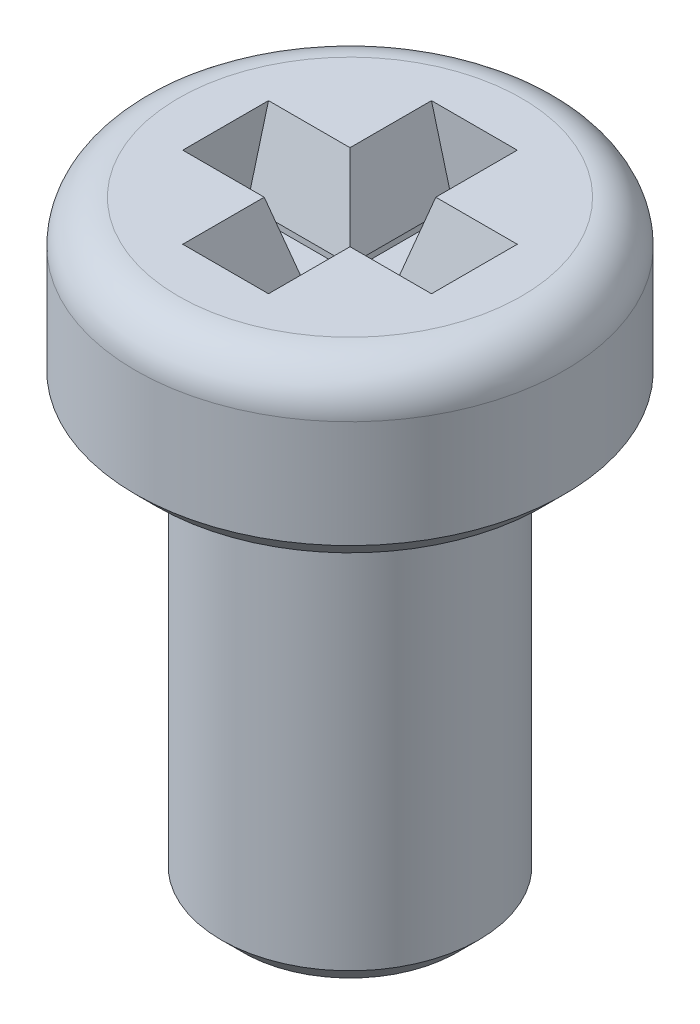
ISO-10303-21;
HEADER;
FILE_DESCRIPTION(('STEP AP214'),'2;1');
FILE_NAME('part.step','',(''),(''),'','','');
FILE_SCHEMA(('AUTOMOTIVE_DESIGN { 1 0 10303 214 1 1 1 1 }'));
ENDSEC;
DATA;
#1=APPLICATION_CONTEXT('core data for automotive mechanical design processes');
#2=APPLICATION_PROTOCOL_DEFINITION('international standard','automotive_design',2000,#1);
#3=PRODUCT_CONTEXT('',#1,'mechanical');
#4=PRODUCT('Part','Part','',(#3));
#5=PRODUCT_RELATED_PRODUCT_CATEGORY('part','',(#4));
#6=PRODUCT_DEFINITION_FORMATION('','',#4);
#7=PRODUCT_DEFINITION_CONTEXT('part definition',#1,'design');
#8=PRODUCT_DEFINITION('design','',#6,#7);
#9=PRODUCT_DEFINITION_SHAPE('','',#8);
#10=(LENGTH_UNIT() NAMED_UNIT(*) SI_UNIT(.MILLI.,.METRE.));
#11=(NAMED_UNIT(*) PLANE_ANGLE_UNIT() SI_UNIT($,.RADIAN.));
#12=(NAMED_UNIT(*) SI_UNIT($,.STERADIAN.) SOLID_ANGLE_UNIT());
#13=UNCERTAINTY_MEASURE_WITH_UNIT(LENGTH_MEASURE(1.E-05),#10,'distance_accuracy_value','');
#14=(GEOMETRIC_REPRESENTATION_CONTEXT(3) GLOBAL_UNCERTAINTY_ASSIGNED_CONTEXT((#13)) GLOBAL_UNIT_ASSIGNED_CONTEXT((#10,
#11,#12)) REPRESENTATION_CONTEXT('',''));
#15=CARTESIAN_POINT('',(0.,0.,0.));
#16=DIRECTION('',(0.,0.,1.));
#17=DIRECTION('',(1.,0.,0.));
#18=AXIS2_PLACEMENT_3D('',#15,#16,#17);
#19=CARTESIAN_POINT('',(0.,2.,0.));
#20=DIRECTION('',(0.,-1.,0.));
#21=DIRECTION('',(0.,0.,-1.));
#22=AXIS2_PLACEMENT_3D('',#19,#20,#21);
#23=CYLINDRICAL_SURFACE('',#22,2.5);
#24=CARTESIAN_POINT('',(0.,1.5,0.));
#25=DIRECTION('',(0.,1.,0.));
#26=DIRECTION('',(0.,0.,1.));
#27=AXIS2_PLACEMENT_3D('',#24,#25,#26);
#28=CIRCLE('',#27,2.5);
#29=CARTESIAN_POINT('',(0.,1.5,2.5));
#30=VERTEX_POINT('',#29);
#31=EDGE_CURVE('E263',#30,#30,#28,.F.);
#32=ORIENTED_EDGE('',*,*,#31,.T.);
#33=EDGE_LOOP('',(#32));
#34=FACE_BOUND('',#33,.T.);
#35=CARTESIAN_POINT('',(0.,0.250000000000001,0.));
#36=DIRECTION('',(0.,1.,0.));
#37=DIRECTION('',(0.,0.,1.));
#38=AXIS2_PLACEMENT_3D('',#35,#36,#37);
#39=CIRCLE('',#38,2.5);
#40=CARTESIAN_POINT('',(0.,0.250000000000001,2.5));
#41=VERTEX_POINT('',#40);
#42=EDGE_CURVE('E254',#41,#41,#39,.T.);
#43=ORIENTED_EDGE('',*,*,#42,.T.);
#44=EDGE_LOOP('',(#43));
#45=FACE_BOUND('',#44,.T.);
#46=ADVANCED_FACE('F32',(#34,#45),#23,.T.);
#47=CARTESIAN_POINT('',(0.,2.,0.));
#48=DIRECTION('',(0.,1.,0.));
#49=DIRECTION('',(0.,0.,1.));
#50=AXIS2_PLACEMENT_3D('',#47,#48,#49);
#51=PLANE('',#50);
#52=DIRECTION('',(1.,0.,0.));
#53=VECTOR('',#52,1.);
#54=CARTESIAN_POINT('',(-0.25,2.,1.45));
#55=LINE('',#54,#53);
#56=CARTESIAN_POINT('',(-0.5,2.,1.45));
#57=VERTEX_POINT('',#56);
#58=CARTESIAN_POINT('',(0.5,2.,1.45));
#59=VERTEX_POINT('',#58);
#60=EDGE_CURVE('E211',#57,#59,#55,.T.);
#61=ORIENTED_EDGE('',*,*,#60,.F.);
#62=DIRECTION('',(0.,0.,-1.));
#63=VECTOR('',#62,1.);
#64=CARTESIAN_POINT('',(-0.5,2.,0.25));
#65=LINE('',#64,#63);
#66=CARTESIAN_POINT('',(-0.5,2.,0.5));
#67=VERTEX_POINT('',#66);
#68=EDGE_CURVE('E287',#57,#67,#65,.T.);
#69=ORIENTED_EDGE('',*,*,#68,.T.);
#70=DIRECTION('',(-1.,0.,0.));
#71=VECTOR('',#70,1.);
#72=CARTESIAN_POINT('',(-1.45,2.,0.5));
#73=LINE('',#72,#71);
#74=CARTESIAN_POINT('',(-1.45,2.,0.5));
#75=VERTEX_POINT('',#74);
#76=EDGE_CURVE('E284',#67,#75,#73,.T.);
#77=ORIENTED_EDGE('',*,*,#76,.T.);
#78=DIRECTION('',(0.,0.,1.));
#79=VECTOR('',#78,1.);
#80=CARTESIAN_POINT('',(-1.45,2.,0.25));
#81=LINE('',#80,#79);
#82=CARTESIAN_POINT('',(-1.45,2.,-0.5));
#83=VERTEX_POINT('',#82);
#84=EDGE_CURVE('E209',#83,#75,#81,.T.);
#85=ORIENTED_EDGE('',*,*,#84,.F.);
#86=DIRECTION('',(1.,0.,0.));
#87=VECTOR('',#86,1.);
#88=CARTESIAN_POINT('',(-0.25,2.,-0.5));
#89=LINE('',#88,#87);
#90=CARTESIAN_POINT('',(-0.5,2.,-0.5));
#91=VERTEX_POINT('',#90);
#92=EDGE_CURVE('E272',#83,#91,#89,.T.);
#93=ORIENTED_EDGE('',*,*,#92,.T.);
#94=DIRECTION('',(0.,0.,-1.));
#95=VECTOR('',#94,1.);
#96=CARTESIAN_POINT('',(-0.5,2.,-1.45));
#97=LINE('',#96,#95);
#98=CARTESIAN_POINT('',(-0.5,2.,-1.45));
#99=VERTEX_POINT('',#98);
#100=EDGE_CURVE('E269',#91,#99,#97,.T.);
#101=ORIENTED_EDGE('',*,*,#100,.T.);
#102=DIRECTION('',(-1.,0.,0.));
#103=VECTOR('',#102,1.);
#104=CARTESIAN_POINT('',(-0.25,2.,-1.45));
#105=LINE('',#104,#103);
#106=CARTESIAN_POINT('',(0.5,2.,-1.45));
#107=VERTEX_POINT('',#106);
#108=EDGE_CURVE('E179',#107,#99,#105,.T.);
#109=ORIENTED_EDGE('',*,*,#108,.F.);
#110=DIRECTION('',(0.,0.,1.));
#111=VECTOR('',#110,1.);
#112=CARTESIAN_POINT('',(0.500000000000001,2.,-0.25));
#113=LINE('',#112,#111);
#114=CARTESIAN_POINT('',(0.500000000000001,2.,-0.500000000000001));
#115=VERTEX_POINT('',#114);
#116=EDGE_CURVE('E274',#107,#115,#113,.T.);
#117=ORIENTED_EDGE('',*,*,#116,.T.);
#118=DIRECTION('',(1.,0.,0.));
#119=VECTOR('',#118,1.);
#120=CARTESIAN_POINT('',(1.45,2.,-0.500000000000001));
#121=LINE('',#120,#119);
#122=CARTESIAN_POINT('',(1.45,2.,-0.500000000000001));
#123=VERTEX_POINT('',#122);
#124=EDGE_CURVE('E276',#115,#123,#121,.T.);
#125=ORIENTED_EDGE('',*,*,#124,.T.);
#126=DIRECTION('',(0.,0.,-1.));
#127=VECTOR('',#126,1.);
#128=CARTESIAN_POINT('',(1.45,2.,0.25));
#129=LINE('',#128,#127);
#130=CARTESIAN_POINT('',(1.45,2.,0.5));
#131=VERTEX_POINT('',#130);
#132=EDGE_CURVE('E181',#131,#123,#129,.T.);
#133=ORIENTED_EDGE('',*,*,#132,.F.);
#134=DIRECTION('',(-1.,0.,0.));
#135=VECTOR('',#134,1.);
#136=CARTESIAN_POINT('',(0.25,2.,0.5));
#137=LINE('',#136,#135);
#138=CARTESIAN_POINT('',(0.5,2.,0.5));
#139=VERTEX_POINT('',#138);
#140=EDGE_CURVE('E279',#131,#139,#137,.T.);
#141=ORIENTED_EDGE('',*,*,#140,.T.);
#142=DIRECTION('',(0.,0.,1.));
#143=VECTOR('',#142,1.);
#144=CARTESIAN_POINT('',(0.5,2.,1.45));
#145=LINE('',#144,#143);
#146=EDGE_CURVE('E281',#139,#59,#145,.T.);
#147=ORIENTED_EDGE('',*,*,#146,.T.);
#148=EDGE_LOOP('',(#61,#69,#77,#85,#93,#101,#109,#117,#125,#133,#141,#147));
#149=FACE_BOUND('',#148,.T.);
#150=CARTESIAN_POINT('',(0.,2.,0.));
#151=DIRECTION('',(0.,1.,0.));
#152=DIRECTION('',(0.,0.,1.));
#153=AXIS2_PLACEMENT_3D('',#150,#151,#152);
#154=CIRCLE('',#153,2.);
#155=CARTESIAN_POINT('',(0.,2.,2.));
#156=VERTEX_POINT('',#155);
#157=EDGE_CURVE('E260',#156,#156,#154,.T.);
#158=ORIENTED_EDGE('',*,*,#157,.T.);
#159=EDGE_LOOP('',(#158));
#160=FACE_BOUND('',#159,.T.);
#161=ADVANCED_FACE('F338',(#149,#160),#51,.T.);
#162=CARTESIAN_POINT('',(0.,0.,0.));
#163=DIRECTION('',(0.,1.,0.));
#164=DIRECTION('',(0.,0.,1.));
#165=AXIS2_PLACEMENT_3D('',#162,#163,#164);
#166=PLANE('',#165);
#167=CARTESIAN_POINT('',(0.,0.,0.));
#168=DIRECTION('',(0.,1.,0.));
#169=DIRECTION('',(0.,0.,1.));
#170=AXIS2_PLACEMENT_3D('',#167,#168,#169);
#171=CIRCLE('',#170,2.25);
#172=CARTESIAN_POINT('',(0.,0.,2.25));
#173=VERTEX_POINT('',#172);
#174=EDGE_CURVE('E257',#173,#173,#171,.F.);
#175=ORIENTED_EDGE('',*,*,#174,.T.);
#176=EDGE_LOOP('',(#175));
#177=FACE_BOUND('',#176,.T.);
#178=CARTESIAN_POINT('',(0.,0.,0.));
#179=DIRECTION('',(0.,1.,0.));
#180=DIRECTION('',(0.,0.,1.));
#181=AXIS2_PLACEMENT_3D('',#178,#179,#180);
#182=CIRCLE('',#181,1.5);
#183=CARTESIAN_POINT('',(0.,0.,1.5));
#184=VERTEX_POINT('',#183);
#185=EDGE_CURVE('E217',#184,#184,#182,.F.);
#186=ORIENTED_EDGE('',*,*,#185,.F.);
#187=EDGE_LOOP('',(#186));
#188=FACE_BOUND('',#187,.T.);
#189=ADVANCED_FACE('F407',(#177,#188),#166,.F.);
#190=CARTESIAN_POINT('',(0.,-5.,0.));
#191=DIRECTION('',(0.,1.,0.));
#192=DIRECTION('',(0.,0.,1.));
#193=AXIS2_PLACEMENT_3D('',#190,#191,#192);
#194=CYLINDRICAL_SURFACE('',#193,1.5);
#195=CARTESIAN_POINT('',(0.,-4.75,0.));
#196=DIRECTION('',(0.,-1.,0.));
#197=DIRECTION('',(0.,0.,-1.));
#198=AXIS2_PLACEMENT_3D('',#195,#196,#197);
#199=CIRCLE('',#198,1.5);
#200=CARTESIAN_POINT('',(0.,-4.75,-1.5));
#201=VERTEX_POINT('',#200);
#202=EDGE_CURVE('E251',#201,#201,#199,.F.);
#203=ORIENTED_EDGE('',*,*,#202,.T.);
#204=EDGE_LOOP('',(#203));
#205=FACE_BOUND('',#204,.T.);
#206=ORIENTED_EDGE('',*,*,#185,.T.);
#207=EDGE_LOOP('',(#206));
#208=FACE_BOUND('',#207,.T.);
#209=ADVANCED_FACE('F461',(#205,#208),#194,.T.);
#210=CARTESIAN_POINT('',(0.,-5.,0.));
#211=DIRECTION('',(0.,-1.,0.));
#212=DIRECTION('',(0.,0.,-1.));
#213=AXIS2_PLACEMENT_3D('',#210,#211,#212);
#214=PLANE('',#213);
#215=CARTESIAN_POINT('',(0.,-5.,0.));
#216=DIRECTION('',(0.,-1.,0.));
#217=DIRECTION('',(0.,0.,-1.));
#218=AXIS2_PLACEMENT_3D('',#215,#216,#217);
#219=CIRCLE('',#218,1.25);
#220=CARTESIAN_POINT('',(0.,-5.,-1.25));
#221=VERTEX_POINT('',#220);
#222=EDGE_CURVE('E248',#221,#221,#219,.T.);
#223=ORIENTED_EDGE('',*,*,#222,.T.);
#224=EDGE_LOOP('',(#223));
#225=FACE_BOUND('',#224,.T.);
#226=ADVANCED_FACE('F416',(#225),#214,.T.);
#227=CARTESIAN_POINT('',(0.,-5.,0.));
#228=DIRECTION('',(0.,1.,0.));
#229=DIRECTION('',(0.,0.,1.));
#230=AXIS2_PLACEMENT_3D('',#227,#228,#229);
#231=CONICAL_SURFACE('',#230,1.25,0.785398163397444);
#232=ORIENTED_EDGE('',*,*,#202,.F.);
#233=EDGE_LOOP('',(#232));
#234=FACE_BOUND('',#233,.T.);
#235=ORIENTED_EDGE('',*,*,#222,.F.);
#236=EDGE_LOOP('',(#235));
#237=FACE_BOUND('',#236,.T.);
#238=ADVANCED_FACE('F412',(#234,#237),#231,.T.);
#239=CARTESIAN_POINT('',(0.,0.250000000000001,0.));
#240=DIRECTION('',(0.,1.,0.));
#241=DIRECTION('',(0.,0.,1.));
#242=AXIS2_PLACEMENT_3D('',#239,#240,#241);
#243=CONICAL_SURFACE('',#242,2.5,0.78539816339745);
#244=ORIENTED_EDGE('',*,*,#174,.F.);
#245=EDGE_LOOP('',(#244));
#246=FACE_BOUND('',#245,.T.);
#247=ORIENTED_EDGE('',*,*,#42,.F.);
#248=EDGE_LOOP('',(#247));
#249=FACE_BOUND('',#248,.T.);
#250=ADVANCED_FACE('F415',(#246,#249),#243,.T.);
#251=CARTESIAN_POINT('',(0.,1.5,0.));
#252=DIRECTION('',(0.,1.,0.));
#253=DIRECTION('',(0.,0.,1.));
#254=AXIS2_PLACEMENT_3D('',#251,#252,#253);
#255=TOROIDAL_SURFACE('',#254,2.,0.5);
#256=ORIENTED_EDGE('',*,*,#31,.F.);
#257=EDGE_LOOP('',(#256));
#258=FACE_BOUND('',#257,.T.);
#259=ORIENTED_EDGE('',*,*,#157,.F.);
#260=EDGE_LOOP('',(#259));
#261=FACE_BOUND('',#260,.T.);
#262=ADVANCED_FACE('F420',(#258,#261),#255,.T.);
#263=CARTESIAN_POINT('',(-0.25,1.,-1.45));
#264=DIRECTION('',(-1.,0.,0.));
#265=DIRECTION('',(0.,0.,1.));
#266=AXIS2_PLACEMENT_3D('',#263,#264,#265);
#267=PLANE('',#266);
#268=DIRECTION('',(0.,1.,0.));
#269=VECTOR('',#268,1.);
#270=CARTESIAN_POINT('',(-0.25,1.,-1.45));
#271=LINE('',#270,#269);
#272=CARTESIAN_POINT('',(-0.25,1.,-1.45));
#273=VERTEX_POINT('',#272);
#274=CARTESIAN_POINT('',(-0.25,1.06698729810778,-1.45));
#275=VERTEX_POINT('',#274);
#276=EDGE_CURVE('E215',#273,#275,#271,.T.);
#277=ORIENTED_EDGE('',*,*,#276,.T.);
#278=DIRECTION('',(0.,0.,1.));
#279=VECTOR('',#278,1.);
#280=CARTESIAN_POINT('',(-0.25,1.06698729810778,-0.25));
#281=LINE('',#280,#279);
#282=CARTESIAN_POINT('',(-0.25,1.06698729810778,-0.25));
#283=VERTEX_POINT('',#282);
#284=EDGE_CURVE('E54',#275,#283,#281,.T.);
#285=ORIENTED_EDGE('',*,*,#284,.T.);
#286=DIRECTION('',(0.,1.,0.));
#287=VECTOR('',#286,1.);
#288=CARTESIAN_POINT('',(-0.25,1.,-0.25));
#289=LINE('',#288,#287);
#290=CARTESIAN_POINT('',(-0.25,1.,-0.25));
#291=VERTEX_POINT('',#290);
#292=EDGE_CURVE('E155',#291,#283,#289,.T.);
#293=ORIENTED_EDGE('',*,*,#292,.F.);
#294=DIRECTION('',(0.,0.,1.));
#295=VECTOR('',#294,1.);
#296=CARTESIAN_POINT('',(-0.25,1.,-1.45));
#297=LINE('',#296,#295);
#298=EDGE_CURVE('E159',#273,#291,#297,.T.);
#299=ORIENTED_EDGE('',*,*,#298,.F.);
#300=EDGE_LOOP('',(#277,#285,#293,#299));
#301=FACE_BOUND('',#300,.T.);
#302=ADVANCED_FACE('F157',(#301),#267,.F.);
#303=CARTESIAN_POINT('',(-0.25,1.,-1.45));
#304=DIRECTION('',(0.,0.,-1.));
#305=DIRECTION('',(-1.,0.,0.));
#306=AXIS2_PLACEMENT_3D('',#303,#304,#305);
#307=PLANE('',#306);
#308=ORIENTED_EDGE('',*,*,#108,.T.);
#309=DIRECTION('',(0.258819045102521,-0.965925826289068,0.));
#310=VECTOR('',#309,1.);
#311=CARTESIAN_POINT('',(-0.233253175473055,1.00448729810778,-1.45));
#312=LINE('',#311,#310);
#313=EDGE_CURVE('E11',#99,#275,#312,.T.);
#314=ORIENTED_EDGE('',*,*,#313,.T.);
#315=ORIENTED_EDGE('',*,*,#276,.F.);
#316=DIRECTION('',(-1.,0.,0.));
#317=VECTOR('',#316,1.);
#318=CARTESIAN_POINT('',(-0.25,1.,-1.45));
#319=LINE('',#318,#317);
#320=CARTESIAN_POINT('',(0.25,1.,-1.45));
#321=VERTEX_POINT('',#320);
#322=EDGE_CURVE('E165',#321,#273,#319,.T.);
#323=ORIENTED_EDGE('',*,*,#322,.F.);
#324=DIRECTION('',(0.,1.,0.));
#325=VECTOR('',#324,1.);
#326=CARTESIAN_POINT('',(0.25,1.,-1.45));
#327=LINE('',#326,#325);
#328=CARTESIAN_POINT('',(0.25,1.06698729810778,-1.45));
#329=VERTEX_POINT('',#328);
#330=EDGE_CURVE('E218',#321,#329,#327,.T.);
#331=ORIENTED_EDGE('',*,*,#330,.T.);
#332=DIRECTION('',(0.258819045102521,0.965925826289068,0.));
#333=VECTOR('',#332,1.);
#334=CARTESIAN_POINT('',(0.199759526419164,0.87948729810778,-1.45));
#335=LINE('',#334,#333);
#336=EDGE_CURVE('E316',#329,#107,#335,.T.);
#337=ORIENTED_EDGE('',*,*,#336,.T.);
#338=EDGE_LOOP('',(#308,#314,#315,#323,#331,#337));
#339=FACE_BOUND('',#338,.T.);
#340=ADVANCED_FACE('F375',(#339),#307,.F.);
#341=CARTESIAN_POINT('',(0.25,1.,-1.45));
#342=DIRECTION('',(1.,0.,0.));
#343=DIRECTION('',(0.,0.,-1.));
#344=AXIS2_PLACEMENT_3D('',#341,#342,#343);
#345=PLANE('',#344);
#346=DIRECTION('',(0.,1.,0.));
#347=VECTOR('',#346,1.);
#348=CARTESIAN_POINT('',(0.25,1.,-0.25));
#349=LINE('',#348,#347);
#350=CARTESIAN_POINT('',(0.25,1.,-0.25));
#351=VERTEX_POINT('',#350);
#352=CARTESIAN_POINT('',(0.25,1.06698729810778,-0.25));
#353=VERTEX_POINT('',#352);
#354=EDGE_CURVE('E221',#351,#353,#349,.T.);
#355=ORIENTED_EDGE('',*,*,#354,.T.);
#356=DIRECTION('',(0.,0.,-1.));
#357=VECTOR('',#356,1.);
#358=CARTESIAN_POINT('',(0.25,1.06698729810778,-1.45));
#359=LINE('',#358,#357);
#360=EDGE_CURVE('E299',#353,#329,#359,.T.);
#361=ORIENTED_EDGE('',*,*,#360,.T.);
#362=ORIENTED_EDGE('',*,*,#330,.F.);
#363=DIRECTION('',(0.,0.,-1.));
#364=VECTOR('',#363,1.);
#365=CARTESIAN_POINT('',(0.25,1.,-1.45));
#366=LINE('',#365,#364);
#367=EDGE_CURVE('E206',#351,#321,#366,.T.);
#368=ORIENTED_EDGE('',*,*,#367,.F.);
#369=EDGE_LOOP('',(#355,#361,#362,#368));
#370=FACE_BOUND('',#369,.T.);
#371=ADVANCED_FACE('F373',(#370),#345,.F.);
#372=CARTESIAN_POINT('',(0.25,1.,-0.25));
#373=DIRECTION('',(0.,0.,-1.));
#374=DIRECTION('',(-1.,0.,0.));
#375=AXIS2_PLACEMENT_3D('',#372,#373,#374);
#376=PLANE('',#375);
#377=DIRECTION('',(0.,1.,0.));
#378=VECTOR('',#377,1.);
#379=CARTESIAN_POINT('',(1.45,1.,-0.25));
#380=LINE('',#379,#378);
#381=CARTESIAN_POINT('',(1.45,1.,-0.25));
#382=VERTEX_POINT('',#381);
#383=CARTESIAN_POINT('',(1.45,1.06698729810778,-0.25));
#384=VERTEX_POINT('',#383);
#385=EDGE_CURVE('E224',#382,#384,#380,.T.);
#386=ORIENTED_EDGE('',*,*,#385,.T.);
#387=DIRECTION('',(-1.,0.,0.));
#388=VECTOR('',#387,1.);
#389=CARTESIAN_POINT('',(0.25,1.06698729810778,-0.25));
#390=LINE('',#389,#388);
#391=EDGE_CURVE('E296',#384,#353,#390,.T.);
#392=ORIENTED_EDGE('',*,*,#391,.T.);
#393=ORIENTED_EDGE('',*,*,#354,.F.);
#394=DIRECTION('',(-1.,0.,0.));
#395=VECTOR('',#394,1.);
#396=CARTESIAN_POINT('',(0.25,1.,-0.25));
#397=LINE('',#396,#395);
#398=EDGE_CURVE('E203',#382,#351,#397,.T.);
#399=ORIENTED_EDGE('',*,*,#398,.F.);
#400=EDGE_LOOP('',(#386,#392,#393,#399));
#401=FACE_BOUND('',#400,.T.);
#402=ADVANCED_FACE('F371',(#401),#376,.F.);
#403=CARTESIAN_POINT('',(1.45,1.,0.25));
#404=DIRECTION('',(1.,0.,0.));
#405=DIRECTION('',(0.,0.,-1.));
#406=AXIS2_PLACEMENT_3D('',#403,#404,#405);
#407=PLANE('',#406);
#408=ORIENTED_EDGE('',*,*,#132,.T.);
#409=DIRECTION('',(0.,-0.965925826289068,0.258819045102521));
#410=VECTOR('',#409,1.);
#411=CARTESIAN_POINT('',(1.45,0.87948729810778,-0.199759526419165));
#412=LINE('',#411,#410);
#413=EDGE_CURVE('E314',#123,#384,#412,.T.);
#414=ORIENTED_EDGE('',*,*,#413,.T.);
#415=ORIENTED_EDGE('',*,*,#385,.F.);
#416=DIRECTION('',(0.,0.,-1.));
#417=VECTOR('',#416,1.);
#418=CARTESIAN_POINT('',(1.45,1.,0.25));
#419=LINE('',#418,#417);
#420=CARTESIAN_POINT('',(1.45,1.,0.25));
#421=VERTEX_POINT('',#420);
#422=EDGE_CURVE('E200',#421,#382,#419,.T.);
#423=ORIENTED_EDGE('',*,*,#422,.F.);
#424=DIRECTION('',(0.,1.,0.));
#425=VECTOR('',#424,1.);
#426=CARTESIAN_POINT('',(1.45,1.,0.25));
#427=LINE('',#426,#425);
#428=CARTESIAN_POINT('',(1.45,1.06698729810778,0.25));
#429=VERTEX_POINT('',#428);
#430=EDGE_CURVE('E227',#421,#429,#427,.T.);
#431=ORIENTED_EDGE('',*,*,#430,.T.);
#432=DIRECTION('',(0.,0.965925826289068,0.258819045102521));
#433=VECTOR('',#432,1.);
#434=CARTESIAN_POINT('',(1.45,1.00448729810778,0.233253175473055));
#435=LINE('',#434,#433);
#436=EDGE_CURVE('E311',#429,#131,#435,.T.);
#437=ORIENTED_EDGE('',*,*,#436,.T.);
#438=EDGE_LOOP('',(#408,#414,#415,#423,#431,#437));
#439=FACE_BOUND('',#438,.T.);
#440=ADVANCED_FACE('F367',(#439),#407,.F.);
#441=CARTESIAN_POINT('',(0.25,1.,0.25));
#442=DIRECTION('',(0.,0.,1.));
#443=DIRECTION('',(1.,0.,0.));
#444=AXIS2_PLACEMENT_3D('',#441,#442,#443);
#445=PLANE('',#444);
#446=DIRECTION('',(0.,1.,0.));
#447=VECTOR('',#446,1.);
#448=CARTESIAN_POINT('',(0.25,1.,0.25));
#449=LINE('',#448,#447);
#450=CARTESIAN_POINT('',(0.25,1.,0.25));
#451=VERTEX_POINT('',#450);
#452=CARTESIAN_POINT('',(0.25,1.06698729810778,0.25));
#453=VERTEX_POINT('',#452);
#454=EDGE_CURVE('E230',#451,#453,#449,.T.);
#455=ORIENTED_EDGE('',*,*,#454,.T.);
#456=DIRECTION('',(1.,0.,0.));
#457=VECTOR('',#456,1.);
#458=CARTESIAN_POINT('',(1.45,1.06698729810778,0.25));
#459=LINE('',#458,#457);
#460=EDGE_CURVE('E294',#453,#429,#459,.T.);
#461=ORIENTED_EDGE('',*,*,#460,.T.);
#462=ORIENTED_EDGE('',*,*,#430,.F.);
#463=DIRECTION('',(1.,0.,0.));
#464=VECTOR('',#463,1.);
#465=CARTESIAN_POINT('',(0.25,1.,0.25));
#466=LINE('',#465,#464);
#467=EDGE_CURVE('E197',#451,#421,#466,.T.);
#468=ORIENTED_EDGE('',*,*,#467,.F.);
#469=EDGE_LOOP('',(#455,#461,#462,#468));
#470=FACE_BOUND('',#469,.T.);
#471=ADVANCED_FACE('F362',(#470),#445,.F.);
#472=CARTESIAN_POINT('',(0.25,1.,0.25));
#473=DIRECTION('',(1.,0.,0.));
#474=DIRECTION('',(0.,0.,-1.));
#475=AXIS2_PLACEMENT_3D('',#472,#473,#474);
#476=PLANE('',#475);
#477=DIRECTION('',(0.,1.,0.));
#478=VECTOR('',#477,1.);
#479=CARTESIAN_POINT('',(0.25,1.,1.45));
#480=LINE('',#479,#478);
#481=CARTESIAN_POINT('',(0.25,1.,1.45));
#482=VERTEX_POINT('',#481);
#483=CARTESIAN_POINT('',(0.25,1.06698729810778,1.45));
#484=VERTEX_POINT('',#483);
#485=EDGE_CURVE('E233',#482,#484,#480,.T.);
#486=ORIENTED_EDGE('',*,*,#485,.T.);
#487=DIRECTION('',(0.,0.,-1.));
#488=VECTOR('',#487,1.);
#489=CARTESIAN_POINT('',(0.25,1.06698729810778,0.25));
#490=LINE('',#489,#488);
#491=EDGE_CURVE('E291',#484,#453,#490,.T.);
#492=ORIENTED_EDGE('',*,*,#491,.T.);
#493=ORIENTED_EDGE('',*,*,#454,.F.);
#494=DIRECTION('',(0.,0.,-1.));
#495=VECTOR('',#494,1.);
#496=CARTESIAN_POINT('',(0.25,1.,0.25));
#497=LINE('',#496,#495);
#498=EDGE_CURVE('E194',#482,#451,#497,.T.);
#499=ORIENTED_EDGE('',*,*,#498,.F.);
#500=EDGE_LOOP('',(#486,#492,#493,#499));
#501=FACE_BOUND('',#500,.T.);
#502=ADVANCED_FACE('F359',(#501),#476,.F.);
#503=CARTESIAN_POINT('',(-0.25,1.,1.45));
#504=DIRECTION('',(0.,0.,1.));
#505=DIRECTION('',(1.,0.,0.));
#506=AXIS2_PLACEMENT_3D('',#503,#504,#505);
#507=PLANE('',#506);
#508=ORIENTED_EDGE('',*,*,#60,.T.);
#509=DIRECTION('',(-0.258819045102521,-0.965925826289068,0.));
#510=VECTOR('',#509,1.);
#511=CARTESIAN_POINT('',(0.199759526419164,0.879487298107781,1.45));
#512=LINE('',#511,#510);
#513=EDGE_CURVE('E309',#59,#484,#512,.T.);
#514=ORIENTED_EDGE('',*,*,#513,.T.);
#515=ORIENTED_EDGE('',*,*,#485,.F.);
#516=DIRECTION('',(1.,0.,0.));
#517=VECTOR('',#516,1.);
#518=CARTESIAN_POINT('',(-0.25,1.,1.45));
#519=LINE('',#518,#517);
#520=CARTESIAN_POINT('',(-0.25,1.,1.45));
#521=VERTEX_POINT('',#520);
#522=EDGE_CURVE('E191',#521,#482,#519,.T.);
#523=ORIENTED_EDGE('',*,*,#522,.F.);
#524=DIRECTION('',(0.,1.,0.));
#525=VECTOR('',#524,1.);
#526=CARTESIAN_POINT('',(-0.25,1.,1.45));
#527=LINE('',#526,#525);
#528=CARTESIAN_POINT('',(-0.25,1.06698729810778,1.45));
#529=VERTEX_POINT('',#528);
#530=EDGE_CURVE('E236',#521,#529,#527,.T.);
#531=ORIENTED_EDGE('',*,*,#530,.T.);
#532=DIRECTION('',(-0.258819045102521,0.965925826289068,0.));
#533=VECTOR('',#532,1.);
#534=CARTESIAN_POINT('',(-0.233253175473054,1.00448729810778,1.45));
#535=LINE('',#534,#533);
#536=EDGE_CURVE('E304',#529,#57,#535,.T.);
#537=ORIENTED_EDGE('',*,*,#536,.T.);
#538=EDGE_LOOP('',(#508,#514,#515,#523,#531,#537));
#539=FACE_BOUND('',#538,.T.);
#540=ADVANCED_FACE('F355',(#539),#507,.F.);
#541=CARTESIAN_POINT('',(-0.25,1.,0.25));
#542=DIRECTION('',(-1.,0.,0.));
#543=DIRECTION('',(0.,0.,1.));
#544=AXIS2_PLACEMENT_3D('',#541,#542,#543);
#545=PLANE('',#544);
#546=DIRECTION('',(0.,1.,0.));
#547=VECTOR('',#546,1.);
#548=CARTESIAN_POINT('',(-0.25,1.,0.25));
#549=LINE('',#548,#547);
#550=CARTESIAN_POINT('',(-0.25,1.,0.25));
#551=VERTEX_POINT('',#550);
#552=CARTESIAN_POINT('',(-0.25,1.06698729810778,0.25));
#553=VERTEX_POINT('',#552);
#554=EDGE_CURVE('E239',#551,#553,#549,.T.);
#555=ORIENTED_EDGE('',*,*,#554,.T.);
#556=DIRECTION('',(0.,0.,1.));
#557=VECTOR('',#556,1.);
#558=CARTESIAN_POINT('',(-0.25,1.06698729810778,1.45));
#559=LINE('',#558,#557);
#560=EDGE_CURVE('E266',#553,#529,#559,.T.);
#561=ORIENTED_EDGE('',*,*,#560,.T.);
#562=ORIENTED_EDGE('',*,*,#530,.F.);
#563=DIRECTION('',(0.,0.,1.));
#564=VECTOR('',#563,1.);
#565=CARTESIAN_POINT('',(-0.25,1.,0.25));
#566=LINE('',#565,#564);
#567=EDGE_CURVE('E188',#551,#521,#566,.T.);
#568=ORIENTED_EDGE('',*,*,#567,.F.);
#569=EDGE_LOOP('',(#555,#561,#562,#568));
#570=FACE_BOUND('',#569,.T.);
#571=ADVANCED_FACE('F351',(#570),#545,.F.);
#572=CARTESIAN_POINT('',(-1.45,1.,0.25));
#573=DIRECTION('',(0.,0.,1.));
#574=DIRECTION('',(1.,0.,0.));
#575=AXIS2_PLACEMENT_3D('',#572,#573,#574);
#576=PLANE('',#575);
#577=DIRECTION('',(0.,1.,0.));
#578=VECTOR('',#577,1.);
#579=CARTESIAN_POINT('',(-1.45,1.,0.25));
#580=LINE('',#579,#578);
#581=CARTESIAN_POINT('',(-1.45,1.,0.25));
#582=VERTEX_POINT('',#581);
#583=CARTESIAN_POINT('',(-1.45,1.06698729810778,0.25));
#584=VERTEX_POINT('',#583);
#585=EDGE_CURVE('E242',#582,#584,#580,.T.);
#586=ORIENTED_EDGE('',*,*,#585,.T.);
#587=DIRECTION('',(1.,0.,0.));
#588=VECTOR('',#587,1.);
#589=CARTESIAN_POINT('',(-0.25,1.06698729810778,0.25));
#590=LINE('',#589,#588);
#591=EDGE_CURVE('E289',#584,#553,#590,.T.);
#592=ORIENTED_EDGE('',*,*,#591,.T.);
#593=ORIENTED_EDGE('',*,*,#554,.F.);
#594=DIRECTION('',(1.,0.,0.));
#595=VECTOR('',#594,1.);
#596=CARTESIAN_POINT('',(-1.45,1.,0.25));
#597=LINE('',#596,#595);
#598=EDGE_CURVE('E185',#582,#551,#597,.T.);
#599=ORIENTED_EDGE('',*,*,#598,.F.);
#600=EDGE_LOOP('',(#586,#592,#593,#599));
#601=FACE_BOUND('',#600,.T.);
#602=ADVANCED_FACE('F347',(#601),#576,.F.);
#603=CARTESIAN_POINT('',(-1.45,1.,0.25));
#604=DIRECTION('',(-1.,0.,0.));
#605=DIRECTION('',(0.,0.,1.));
#606=AXIS2_PLACEMENT_3D('',#603,#604,#605);
#607=PLANE('',#606);
#608=ORIENTED_EDGE('',*,*,#84,.T.);
#609=DIRECTION('',(0.,-0.965925826289068,-0.258819045102521));
#610=VECTOR('',#609,1.);
#611=CARTESIAN_POINT('',(-1.45,1.00448729810778,0.233253175473055));
#612=LINE('',#611,#610);
#613=EDGE_CURVE('E307',#75,#584,#612,.T.);
#614=ORIENTED_EDGE('',*,*,#613,.T.);
#615=ORIENTED_EDGE('',*,*,#585,.F.);
#616=DIRECTION('',(0.,0.,1.));
#617=VECTOR('',#616,1.);
#618=CARTESIAN_POINT('',(-1.45,1.,0.25));
#619=LINE('',#618,#617);
#620=CARTESIAN_POINT('',(-1.45,1.,-0.25));
#621=VERTEX_POINT('',#620);
#622=EDGE_CURVE('E174',#621,#582,#619,.T.);
#623=ORIENTED_EDGE('',*,*,#622,.F.);
#624=DIRECTION('',(0.,1.,0.));
#625=VECTOR('',#624,1.);
#626=CARTESIAN_POINT('',(-1.45,1.,-0.25));
#627=LINE('',#626,#625);
#628=CARTESIAN_POINT('',(-1.45,1.06698729810778,-0.25));
#629=VERTEX_POINT('',#628);
#630=EDGE_CURVE('E164',#621,#629,#627,.T.);
#631=ORIENTED_EDGE('',*,*,#630,.T.);
#632=DIRECTION('',(0.,0.965925826289068,-0.258819045102521));
#633=VECTOR('',#632,1.);
#634=CARTESIAN_POINT('',(-1.45,0.87948729810778,-0.199759526419164));
#635=LINE('',#634,#633);
#636=EDGE_CURVE('E41',#629,#83,#635,.T.);
#637=ORIENTED_EDGE('',*,*,#636,.T.);
#638=EDGE_LOOP('',(#608,#614,#615,#623,#631,#637));
#639=FACE_BOUND('',#638,.T.);
#640=ADVANCED_FACE('F343',(#639),#607,.F.);
#641=CARTESIAN_POINT('',(-1.45,1.,-0.25));
#642=DIRECTION('',(0.,0.,-1.));
#643=DIRECTION('',(-1.,0.,0.));
#644=AXIS2_PLACEMENT_3D('',#641,#642,#643);
#645=PLANE('',#644);
#646=ORIENTED_EDGE('',*,*,#292,.T.);
#647=DIRECTION('',(-1.,0.,0.));
#648=VECTOR('',#647,1.);
#649=CARTESIAN_POINT('',(-1.45,1.06698729810778,-0.25));
#650=LINE('',#649,#648);
#651=EDGE_CURVE('E301',#283,#629,#650,.T.);
#652=ORIENTED_EDGE('',*,*,#651,.T.);
#653=ORIENTED_EDGE('',*,*,#630,.F.);
#654=DIRECTION('',(-1.,0.,0.));
#655=VECTOR('',#654,1.);
#656=CARTESIAN_POINT('',(-1.45,1.,-0.25));
#657=LINE('',#656,#655);
#658=EDGE_CURVE('E168',#291,#621,#657,.T.);
#659=ORIENTED_EDGE('',*,*,#658,.F.);
#660=EDGE_LOOP('',(#646,#652,#653,#659));
#661=FACE_BOUND('',#660,.T.);
#662=ADVANCED_FACE('F169',(#661),#645,.F.);
#663=CARTESIAN_POINT('',(0.,1.,0.));
#664=DIRECTION('',(0.,1.,0.));
#665=DIRECTION('',(0.,0.,1.));
#666=AXIS2_PLACEMENT_3D('',#663,#664,#665);
#667=PLANE('',#666);
#668=ORIENTED_EDGE('',*,*,#298,.T.);
#669=ORIENTED_EDGE('',*,*,#658,.T.);
#670=ORIENTED_EDGE('',*,*,#622,.T.);
#671=ORIENTED_EDGE('',*,*,#598,.T.);
#672=ORIENTED_EDGE('',*,*,#567,.T.);
#673=ORIENTED_EDGE('',*,*,#522,.T.);
#674=ORIENTED_EDGE('',*,*,#498,.T.);
#675=ORIENTED_EDGE('',*,*,#467,.T.);
#676=ORIENTED_EDGE('',*,*,#422,.T.);
#677=ORIENTED_EDGE('',*,*,#398,.T.);
#678=ORIENTED_EDGE('',*,*,#367,.T.);
#679=ORIENTED_EDGE('',*,*,#322,.T.);
#680=EDGE_LOOP('',(#668,#669,#670,#671,#672,#673,#674,#675,#676,#677,#678,#679));
#681=FACE_BOUND('',#680,.T.);
#682=ADVANCED_FACE('F176',(#681),#667,.T.);
#683=CARTESIAN_POINT('',(-1.45,1.06698729810778,0.25));
#684=DIRECTION('',(0.,0.258819045102521,-0.965925826289068));
#685=DIRECTION('',(-1.,0.,0.));
#686=AXIS2_PLACEMENT_3D('',#683,#684,#685);
#687=PLANE('',#686);
#688=ORIENTED_EDGE('',*,*,#613,.F.);
#689=ORIENTED_EDGE('',*,*,#76,.F.);
#690=DIRECTION('',(0.250562807085732,-0.935113126531029,-0.250562807085732));
#691=VECTOR('',#690,1.);
#692=CARTESIAN_POINT('',(-0.325338064353618,1.34815278201938,0.325338064353618));
#693=LINE('',#692,#691);
#694=EDGE_CURVE('E212',#553,#67,#693,.F.);
#695=ORIENTED_EDGE('',*,*,#694,.F.);
#696=ORIENTED_EDGE('',*,*,#591,.F.);
#697=EDGE_LOOP('',(#688,#689,#695,#696));
#698=FACE_BOUND('',#697,.T.);
#699=ADVANCED_FACE('F397',(#698),#687,.T.);
#700=CARTESIAN_POINT('',(-0.25,1.06698729810778,0.25));
#701=DIRECTION('',(0.965925826289068,0.258819045102521,0.));
#702=DIRECTION('',(0.,0.,-1.));
#703=AXIS2_PLACEMENT_3D('',#700,#701,#702);
#704=PLANE('',#703);
#705=ORIENTED_EDGE('',*,*,#694,.T.);
#706=ORIENTED_EDGE('',*,*,#68,.F.);
#707=ORIENTED_EDGE('',*,*,#536,.F.);
#708=ORIENTED_EDGE('',*,*,#560,.F.);
#709=EDGE_LOOP('',(#705,#706,#707,#708));
#710=FACE_BOUND('',#709,.T.);
#711=ADVANCED_FACE('F390',(#710),#704,.T.);
#712=CARTESIAN_POINT('',(0.25,1.06698729810778,0.25));
#713=DIRECTION('',(0.,0.258819045102521,-0.965925826289068));
#714=DIRECTION('',(-1.,0.,0.));
#715=AXIS2_PLACEMENT_3D('',#712,#713,#714);
#716=PLANE('',#715);
#717=ORIENTED_EDGE('',*,*,#436,.F.);
#718=ORIENTED_EDGE('',*,*,#460,.F.);
#719=DIRECTION('',(0.250562807085732,0.935113126531029,0.250562807085732));
#720=VECTOR('',#719,1.);
#721=CARTESIAN_POINT('',(0.25,1.06698729810778,0.25));
#722=LINE('',#721,#720);
#723=EDGE_CURVE('E323',#139,#453,#722,.F.);
#724=ORIENTED_EDGE('',*,*,#723,.F.);
#725=ORIENTED_EDGE('',*,*,#140,.F.);
#726=EDGE_LOOP('',(#717,#718,#724,#725));
#727=FACE_BOUND('',#726,.T.);
#728=ADVANCED_FACE('F388',(#727),#716,.T.);
#729=CARTESIAN_POINT('',(0.25,1.06698729810778,0.25));
#730=DIRECTION('',(-0.965925826289068,0.258819045102521,0.));
#731=DIRECTION('',(0.,0.,1.));
#732=AXIS2_PLACEMENT_3D('',#729,#730,#731);
#733=PLANE('',#732);
#734=ORIENTED_EDGE('',*,*,#513,.F.);
#735=ORIENTED_EDGE('',*,*,#146,.F.);
#736=ORIENTED_EDGE('',*,*,#723,.T.);
#737=ORIENTED_EDGE('',*,*,#491,.F.);
#738=EDGE_LOOP('',(#734,#735,#736,#737));
#739=FACE_BOUND('',#738,.T.);
#740=ADVANCED_FACE('F387',(#739),#733,.T.);
#741=CARTESIAN_POINT('',(0.25,1.06698729810778,-1.45));
#742=DIRECTION('',(-0.965925826289068,0.258819045102521,0.));
#743=DIRECTION('',(0.,0.,1.));
#744=AXIS2_PLACEMENT_3D('',#741,#742,#743);
#745=PLANE('',#744);
#746=ORIENTED_EDGE('',*,*,#336,.F.);
#747=ORIENTED_EDGE('',*,*,#360,.F.);
#748=DIRECTION('',(0.250562807085732,0.935113126531029,-0.250562807085732));
#749=VECTOR('',#748,1.);
#750=CARTESIAN_POINT('',(0.325338064353618,1.34815278201938,-0.325338064353618));
#751=LINE('',#750,#749);
#752=EDGE_CURVE('E324',#115,#353,#751,.F.);
#753=ORIENTED_EDGE('',*,*,#752,.F.);
#754=ORIENTED_EDGE('',*,*,#116,.F.);
#755=EDGE_LOOP('',(#746,#747,#753,#754));
#756=FACE_BOUND('',#755,.T.);
#757=ADVANCED_FACE('F378',(#756),#745,.T.);
#758=CARTESIAN_POINT('',(0.25,1.06698729810778,-0.25));
#759=DIRECTION('',(0.,0.258819045102521,0.965925826289068));
#760=DIRECTION('',(1.,0.,0.));
#761=AXIS2_PLACEMENT_3D('',#758,#759,#760);
#762=PLANE('',#761);
#763=ORIENTED_EDGE('',*,*,#413,.F.);
#764=ORIENTED_EDGE('',*,*,#124,.F.);
#765=ORIENTED_EDGE('',*,*,#752,.T.);
#766=ORIENTED_EDGE('',*,*,#391,.F.);
#767=EDGE_LOOP('',(#763,#764,#765,#766));
#768=FACE_BOUND('',#767,.T.);
#769=ADVANCED_FACE('F380',(#768),#762,.T.);
#770=CARTESIAN_POINT('',(-0.25,1.06698729810778,-1.45));
#771=DIRECTION('',(0.965925826289068,0.258819045102521,0.));
#772=DIRECTION('',(0.,0.,-1.));
#773=AXIS2_PLACEMENT_3D('',#770,#771,#772);
#774=PLANE('',#773);
#775=ORIENTED_EDGE('',*,*,#313,.F.);
#776=ORIENTED_EDGE('',*,*,#100,.F.);
#777=DIRECTION('',(0.250562807085732,-0.935113126531029,0.250562807085732));
#778=VECTOR('',#777,1.);
#779=CARTESIAN_POINT('',(-0.325338064353618,1.34815278201938,-0.325338064353618));
#780=LINE('',#779,#778);
#781=EDGE_CURVE('E36',#283,#91,#780,.F.);
#782=ORIENTED_EDGE('',*,*,#781,.F.);
#783=ORIENTED_EDGE('',*,*,#284,.F.);
#784=EDGE_LOOP('',(#775,#776,#782,#783));
#785=FACE_BOUND('',#784,.T.);
#786=ADVANCED_FACE('F34',(#785),#774,.T.);
#787=CARTESIAN_POINT('',(-1.45,1.06698729810778,-0.25));
#788=DIRECTION('',(0.,0.258819045102521,0.965925826289068));
#789=DIRECTION('',(1.,0.,0.));
#790=AXIS2_PLACEMENT_3D('',#787,#788,#789);
#791=PLANE('',#790);
#792=ORIENTED_EDGE('',*,*,#781,.T.);
#793=ORIENTED_EDGE('',*,*,#92,.F.);
#794=ORIENTED_EDGE('',*,*,#636,.F.);
#795=ORIENTED_EDGE('',*,*,#651,.F.);
#796=EDGE_LOOP('',(#792,#793,#794,#795));
#797=FACE_BOUND('',#796,.T.);
#798=ADVANCED_FACE('F334',(#797),#791,.T.);
#799=CLOSED_SHELL('',(#46,#161,#189,#209,#226,#238,#250,#262,#302,#340,#371,#402,#440,#471,#502,
#540,#571,#602,#640,#662,#682,#699,#711,#728,#740,#757,#769,#786,#798));
#800=MANIFOLD_SOLID_BREP('B2',#799);
#801=ADVANCED_BREP_SHAPE_REPRESENTATION('',(#18,#800),#14);
#802=SHAPE_DEFINITION_REPRESENTATION(#9,#801);
ENDSEC;
END-ISO-10303-21;
